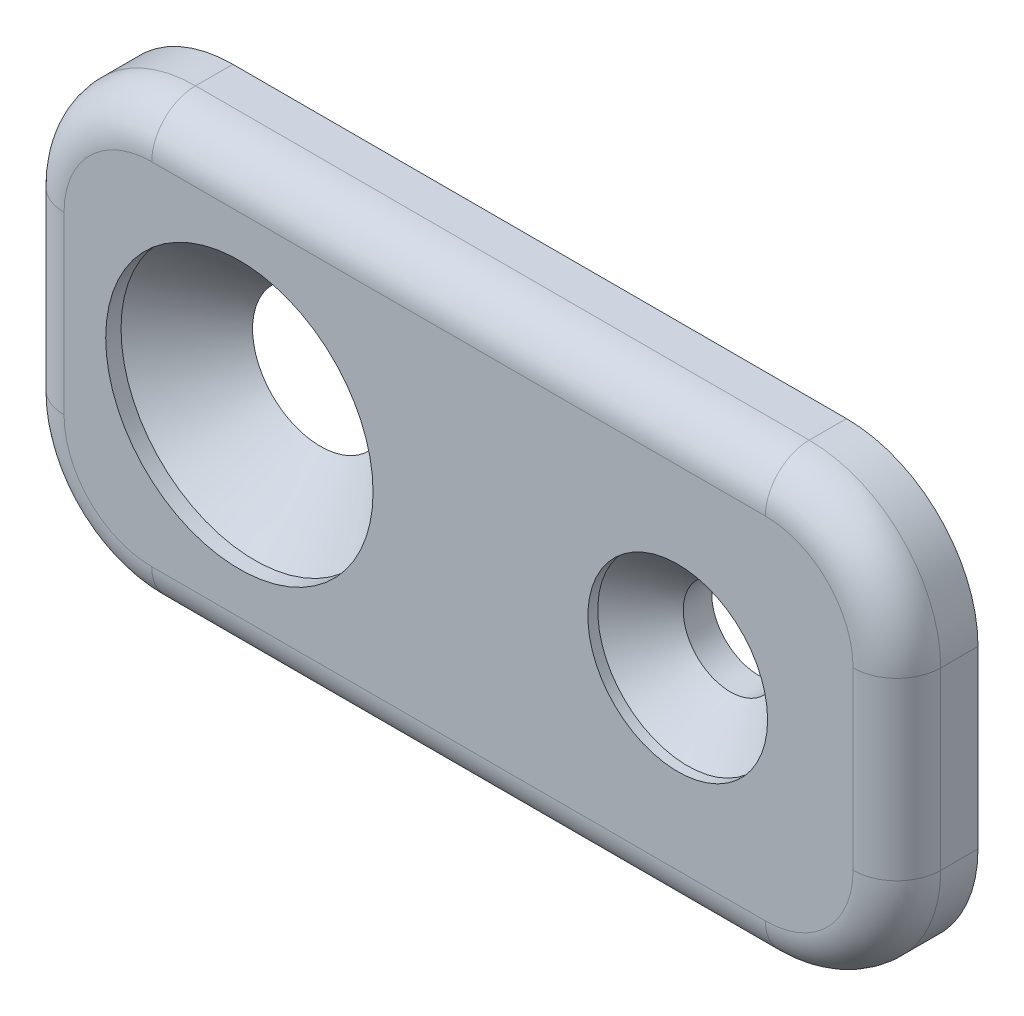
ISO-10303-21;
HEADER;
FILE_DESCRIPTION(('STEP AP214'),'2;1');
FILE_NAME('part.step','',(''),(''),'','','');
FILE_SCHEMA(('AUTOMOTIVE_DESIGN { 1 0 10303 214 1 1 1 1 }'));
ENDSEC;
DATA;
#1=APPLICATION_CONTEXT('core data for automotive mechanical design processes');
#2=APPLICATION_PROTOCOL_DEFINITION('international standard','automotive_design',2000,#1);
#3=PRODUCT_CONTEXT('',#1,'mechanical');
#4=PRODUCT('Part','Part','',(#3));
#5=PRODUCT_RELATED_PRODUCT_CATEGORY('part','',(#4));
#6=PRODUCT_DEFINITION_FORMATION('','',#4);
#7=PRODUCT_DEFINITION_CONTEXT('part definition',#1,'design');
#8=PRODUCT_DEFINITION('design','',#6,#7);
#9=PRODUCT_DEFINITION_SHAPE('','',#8);
#10=(LENGTH_UNIT() NAMED_UNIT(*) SI_UNIT(.MILLI.,.METRE.));
#11=(NAMED_UNIT(*) PLANE_ANGLE_UNIT() SI_UNIT($,.RADIAN.));
#12=(NAMED_UNIT(*) SI_UNIT($,.STERADIAN.) SOLID_ANGLE_UNIT());
#13=UNCERTAINTY_MEASURE_WITH_UNIT(LENGTH_MEASURE(1.E-05),#10,'distance_accuracy_value','');
#14=(GEOMETRIC_REPRESENTATION_CONTEXT(3) GLOBAL_UNCERTAINTY_ASSIGNED_CONTEXT((#13)) GLOBAL_UNIT_ASSIGNED_CONTEXT((#10,
#11,#12)) REPRESENTATION_CONTEXT('',''));
#15=CARTESIAN_POINT('',(0.,0.,0.));
#16=DIRECTION('',(0.,0.,1.));
#17=DIRECTION('',(1.,0.,0.));
#18=AXIS2_PLACEMENT_3D('',#15,#16,#17);
#19=CARTESIAN_POINT('',(20.,0.,3.7));
#20=DIRECTION('',(0.,0.,-1.));
#21=DIRECTION('',(-1.,0.,0.));
#22=AXIS2_PLACEMENT_3D('',#19,#20,#21);
#23=CYLINDRICAL_SURFACE('',#22,2.15);
#24=CARTESIAN_POINT('',(20.,0.,1.29999999999996));
#25=DIRECTION('',(0.,0.,1.));
#26=DIRECTION('',(1.,0.,0.));
#27=AXIS2_PLACEMENT_3D('',#24,#25,#26);
#28=CIRCLE('',#27,2.15);
#29=CARTESIAN_POINT('',(22.15,0.,1.29999999999996));
#30=VERTEX_POINT('',#29);
#31=EDGE_CURVE('E160',#30,#30,#28,.T.);
#32=ORIENTED_EDGE('',*,*,#31,.T.);
#33=EDGE_LOOP('',(#32));
#34=FACE_BOUND('',#33,.T.);
#35=CARTESIAN_POINT('',(20.,0.,0.));
#36=DIRECTION('',(0.,0.,1.));
#37=DIRECTION('',(1.,0.,0.));
#38=AXIS2_PLACEMENT_3D('',#35,#36,#37);
#39=CIRCLE('',#38,2.15);
#40=CARTESIAN_POINT('',(22.15,0.,0.));
#41=VERTEX_POINT('',#40);
#42=EDGE_CURVE('E253',#41,#41,#39,.T.);
#43=ORIENTED_EDGE('',*,*,#42,.F.);
#44=EDGE_LOOP('',(#43));
#45=FACE_BOUND('',#44,.T.);
#46=ADVANCED_FACE('F36',(#34,#45),#23,.F.);
#47=CARTESIAN_POINT('',(0.,0.,3.7));
#48=DIRECTION('',(0.,0.,-1.));
#49=DIRECTION('',(-1.,0.,0.));
#50=AXIS2_PLACEMENT_3D('',#47,#48,#49);
#51=PLANE('',#50);
#52=CARTESIAN_POINT('',(-4.,-4.00000000000001,3.7));
#53=DIRECTION('',(0.,0.,-1.));
#54=DIRECTION('',(-1.,0.,0.));
#55=AXIS2_PLACEMENT_3D('',#52,#53,#54);
#56=CIRCLE('',#55,4.);
#57=CARTESIAN_POINT('',(-8.,-4.00000000000001,3.7));
#58=VERTEX_POINT('',#57);
#59=CARTESIAN_POINT('',(-4.,-8.00000000000001,3.7));
#60=VERTEX_POINT('',#59);
#61=EDGE_CURVE('E186',#58,#60,#56,.F.);
#62=ORIENTED_EDGE('',*,*,#61,.T.);
#63=DIRECTION('',(1.,0.,0.));
#64=VECTOR('',#63,1.);
#65=CARTESIAN_POINT('',(0.,-8.00000000000001,3.7));
#66=LINE('',#65,#64);
#67=CARTESIAN_POINT('',(24.,-8.,3.7));
#68=VERTEX_POINT('',#67);
#69=EDGE_CURVE('E200',#60,#68,#66,.T.);
#70=ORIENTED_EDGE('',*,*,#69,.T.);
#71=CARTESIAN_POINT('',(24.,-4.,3.7));
#72=DIRECTION('',(0.,0.,-1.));
#73=DIRECTION('',(-1.,0.,0.));
#74=AXIS2_PLACEMENT_3D('',#71,#72,#73);
#75=CIRCLE('',#74,4.);
#76=CARTESIAN_POINT('',(28.,-4.,3.7));
#77=VERTEX_POINT('',#76);
#78=EDGE_CURVE('E198',#68,#77,#75,.F.);
#79=ORIENTED_EDGE('',*,*,#78,.T.);
#80=DIRECTION('',(0.,1.,0.));
#81=VECTOR('',#80,1.);
#82=CARTESIAN_POINT('',(28.,0.,3.7));
#83=LINE('',#82,#81);
#84=CARTESIAN_POINT('',(28.,4.,3.7));
#85=VERTEX_POINT('',#84);
#86=EDGE_CURVE('E196',#77,#85,#83,.T.);
#87=ORIENTED_EDGE('',*,*,#86,.T.);
#88=CARTESIAN_POINT('',(24.,4.,3.7));
#89=DIRECTION('',(0.,0.,-1.));
#90=DIRECTION('',(-1.,0.,0.));
#91=AXIS2_PLACEMENT_3D('',#88,#89,#90);
#92=CIRCLE('',#91,4.);
#93=CARTESIAN_POINT('',(24.,8.,3.7));
#94=VERTEX_POINT('',#93);
#95=EDGE_CURVE('E194',#85,#94,#92,.F.);
#96=ORIENTED_EDGE('',*,*,#95,.T.);
#97=DIRECTION('',(-1.,0.,0.));
#98=VECTOR('',#97,1.);
#99=CARTESIAN_POINT('',(0.,7.99999999999999,3.7));
#100=LINE('',#99,#98);
#101=CARTESIAN_POINT('',(-4.,7.99999999999999,3.7));
#102=VERTEX_POINT('',#101);
#103=EDGE_CURVE('E192',#94,#102,#100,.T.);
#104=ORIENTED_EDGE('',*,*,#103,.T.);
#105=CARTESIAN_POINT('',(-4.,3.99999999999999,3.7));
#106=DIRECTION('',(0.,0.,-1.));
#107=DIRECTION('',(-1.,0.,0.));
#108=AXIS2_PLACEMENT_3D('',#105,#106,#107);
#109=CIRCLE('',#108,4.);
#110=CARTESIAN_POINT('',(-8.,3.99999999999999,3.7));
#111=VERTEX_POINT('',#110);
#112=EDGE_CURVE('E190',#102,#111,#109,.F.);
#113=ORIENTED_EDGE('',*,*,#112,.T.);
#114=DIRECTION('',(0.,-1.,0.));
#115=VECTOR('',#114,1.);
#116=CARTESIAN_POINT('',(-8.,0.,3.7));
#117=LINE('',#116,#115);
#118=EDGE_CURVE('E188',#111,#58,#117,.T.);
#119=ORIENTED_EDGE('',*,*,#118,.T.);
#120=EDGE_LOOP('',(#62,#70,#79,#87,#96,#104,#113,#119));
#121=FACE_BOUND('',#120,.T.);
#122=CARTESIAN_POINT('',(20.,0.,3.7));
#123=DIRECTION('',(0.,0.,1.));
#124=DIRECTION('',(1.,0.,0.));
#125=AXIS2_PLACEMENT_3D('',#122,#123,#124);
#126=CIRCLE('',#125,4.1);
#127=CARTESIAN_POINT('',(24.1,0.,3.7));
#128=VERTEX_POINT('',#127);
#129=EDGE_CURVE('E238',#128,#128,#126,.T.);
#130=ORIENTED_EDGE('',*,*,#129,.F.);
#131=EDGE_LOOP('',(#130));
#132=FACE_BOUND('',#131,.T.);
#133=CARTESIAN_POINT('',(0.,0.,3.7));
#134=DIRECTION('',(0.,0.,1.));
#135=DIRECTION('',(1.,0.,0.));
#136=AXIS2_PLACEMENT_3D('',#133,#134,#135);
#137=CIRCLE('',#136,6.1);
#138=CARTESIAN_POINT('',(6.1,0.,3.7));
#139=VERTEX_POINT('',#138);
#140=EDGE_CURVE('E244',#139,#139,#137,.T.);
#141=ORIENTED_EDGE('',*,*,#140,.F.);
#142=EDGE_LOOP('',(#141));
#143=FACE_BOUND('',#142,.T.);
#144=ADVANCED_FACE('F279',(#121,#132,#143),#51,.F.);
#145=CARTESIAN_POINT('',(0.,0.,0.));
#146=DIRECTION('',(0.,0.,-1.));
#147=DIRECTION('',(-1.,0.,0.));
#148=AXIS2_PLACEMENT_3D('',#145,#146,#147);
#149=PLANE('',#148);
#150=CARTESIAN_POINT('',(0.,0.,0.));
#151=DIRECTION('',(0.,0.,1.));
#152=DIRECTION('',(1.,0.,0.));
#153=AXIS2_PLACEMENT_3D('',#150,#151,#152);
#154=CIRCLE('',#153,3.1);
#155=CARTESIAN_POINT('',(3.1,0.,0.));
#156=VERTEX_POINT('',#155);
#157=EDGE_CURVE('E257',#156,#156,#154,.T.);
#158=ORIENTED_EDGE('',*,*,#157,.T.);
#159=EDGE_LOOP('',(#158));
#160=FACE_BOUND('',#159,.T.);
#161=DIRECTION('',(0.,1.,0.));
#162=VECTOR('',#161,1.);
#163=CARTESIAN_POINT('',(30.,10.,0.));
#164=LINE('',#163,#162);
#165=CARTESIAN_POINT('',(30.,-4.,0.));
#166=VERTEX_POINT('',#165);
#167=CARTESIAN_POINT('',(30.,4.,0.));
#168=VERTEX_POINT('',#167);
#169=EDGE_CURVE('E131',#166,#168,#164,.T.);
#170=ORIENTED_EDGE('',*,*,#169,.F.);
#171=CARTESIAN_POINT('',(24.,-4.,0.));
#172=DIRECTION('',(0.,0.,-1.));
#173=DIRECTION('',(-1.,0.,0.));
#174=AXIS2_PLACEMENT_3D('',#171,#172,#173);
#175=CIRCLE('',#174,6.);
#176=CARTESIAN_POINT('',(24.,-10.,0.));
#177=VERTEX_POINT('',#176);
#178=EDGE_CURVE('E141',#166,#177,#175,.T.);
#179=ORIENTED_EDGE('',*,*,#178,.T.);
#180=DIRECTION('',(1.,0.,0.));
#181=VECTOR('',#180,1.);
#182=CARTESIAN_POINT('',(30.,-10.,0.));
#183=LINE('',#182,#181);
#184=CARTESIAN_POINT('',(-4.,-10.,0.));
#185=VERTEX_POINT('',#184);
#186=EDGE_CURVE('E157',#185,#177,#183,.T.);
#187=ORIENTED_EDGE('',*,*,#186,.F.);
#188=CARTESIAN_POINT('',(-4.,-4.00000000000001,0.));
#189=DIRECTION('',(0.,0.,-1.));
#190=DIRECTION('',(-1.,0.,0.));
#191=AXIS2_PLACEMENT_3D('',#188,#189,#190);
#192=CIRCLE('',#191,6.);
#193=CARTESIAN_POINT('',(-10.,-4.00000000000001,0.));
#194=VERTEX_POINT('',#193);
#195=EDGE_CURVE('E149',#185,#194,#192,.T.);
#196=ORIENTED_EDGE('',*,*,#195,.T.);
#197=DIRECTION('',(0.,-1.,0.));
#198=VECTOR('',#197,1.);
#199=CARTESIAN_POINT('',(-10.,9.99999999999999,0.));
#200=LINE('',#199,#198);
#201=CARTESIAN_POINT('',(-10.,3.99999999999999,0.));
#202=VERTEX_POINT('',#201);
#203=EDGE_CURVE('E162',#202,#194,#200,.T.);
#204=ORIENTED_EDGE('',*,*,#203,.F.);
#205=CARTESIAN_POINT('',(-4.,3.99999999999999,0.));
#206=DIRECTION('',(0.,0.,-1.));
#207=DIRECTION('',(-1.,0.,0.));
#208=AXIS2_PLACEMENT_3D('',#205,#206,#207);
#209=CIRCLE('',#208,6.);
#210=CARTESIAN_POINT('',(-4.,9.99999999999999,0.));
#211=VERTEX_POINT('',#210);
#212=EDGE_CURVE('E137',#202,#211,#209,.T.);
#213=ORIENTED_EDGE('',*,*,#212,.T.);
#214=DIRECTION('',(-1.,0.,0.));
#215=VECTOR('',#214,1.);
#216=CARTESIAN_POINT('',(30.,10.,0.));
#217=LINE('',#216,#215);
#218=CARTESIAN_POINT('',(24.,10.,0.));
#219=VERTEX_POINT('',#218);
#220=EDGE_CURVE('E156',#219,#211,#217,.T.);
#221=ORIENTED_EDGE('',*,*,#220,.F.);
#222=CARTESIAN_POINT('',(24.,4.,0.));
#223=DIRECTION('',(0.,0.,-1.));
#224=DIRECTION('',(-1.,0.,0.));
#225=AXIS2_PLACEMENT_3D('',#222,#223,#224);
#226=CIRCLE('',#225,6.);
#227=EDGE_CURVE('E155',#219,#168,#226,.T.);
#228=ORIENTED_EDGE('',*,*,#227,.T.);
#229=EDGE_LOOP('',(#170,#179,#187,#196,#204,#213,#221,#228));
#230=FACE_BOUND('',#229,.T.);
#231=ORIENTED_EDGE('',*,*,#42,.T.);
#232=EDGE_LOOP('',(#231));
#233=FACE_BOUND('',#232,.T.);
#234=ADVANCED_FACE('F151',(#160,#230,#233),#149,.T.);
#235=CARTESIAN_POINT('',(-10.,9.99999999999999,3.7));
#236=DIRECTION('',(1.,0.,0.));
#237=DIRECTION('',(0.,1.,0.));
#238=AXIS2_PLACEMENT_3D('',#235,#236,#237);
#239=PLANE('',#238);
#240=DIRECTION('',(0.,0.,-1.));
#241=VECTOR('',#240,1.);
#242=CARTESIAN_POINT('',(-10.,-4.00000000000001,3.7));
#243=LINE('',#242,#241);
#244=CARTESIAN_POINT('',(-10.,-4.00000000000001,1.7));
#245=VERTEX_POINT('',#244);
#246=EDGE_CURVE('E179',#194,#245,#243,.F.);
#247=ORIENTED_EDGE('',*,*,#246,.T.);
#248=DIRECTION('',(0.,-1.,0.));
#249=VECTOR('',#248,1.);
#250=CARTESIAN_POINT('',(-10.,9.99999999999999,1.7));
#251=LINE('',#250,#249);
#252=CARTESIAN_POINT('',(-10.,3.99999999999999,1.7));
#253=VERTEX_POINT('',#252);
#254=EDGE_CURVE('E45',#245,#253,#251,.F.);
#255=ORIENTED_EDGE('',*,*,#254,.T.);
#256=DIRECTION('',(0.,0.,-1.));
#257=VECTOR('',#256,1.);
#258=CARTESIAN_POINT('',(-10.,3.99999999999999,3.7));
#259=LINE('',#258,#257);
#260=EDGE_CURVE('E177',#253,#202,#259,.T.);
#261=ORIENTED_EDGE('',*,*,#260,.T.);
#262=ORIENTED_EDGE('',*,*,#203,.T.);
#263=EDGE_LOOP('',(#247,#255,#261,#262));
#264=FACE_BOUND('',#263,.T.);
#265=ADVANCED_FACE('F261',(#264),#239,.F.);
#266=CARTESIAN_POINT('',(30.,-10.,3.7));
#267=DIRECTION('',(0.,1.,0.));
#268=DIRECTION('',(-1.,0.,0.));
#269=AXIS2_PLACEMENT_3D('',#266,#267,#268);
#270=PLANE('',#269);
#271=DIRECTION('',(0.,0.,-1.));
#272=VECTOR('',#271,1.);
#273=CARTESIAN_POINT('',(24.,-10.,3.7));
#274=LINE('',#273,#272);
#275=CARTESIAN_POINT('',(24.,-10.,1.7));
#276=VERTEX_POINT('',#275);
#277=EDGE_CURVE('E144',#177,#276,#274,.F.);
#278=ORIENTED_EDGE('',*,*,#277,.T.);
#279=DIRECTION('',(1.,0.,0.));
#280=VECTOR('',#279,1.);
#281=CARTESIAN_POINT('',(30.,-10.,1.7));
#282=LINE('',#281,#280);
#283=CARTESIAN_POINT('',(-4.,-10.,1.7));
#284=VERTEX_POINT('',#283);
#285=EDGE_CURVE('E203',#276,#284,#282,.F.);
#286=ORIENTED_EDGE('',*,*,#285,.T.);
#287=DIRECTION('',(0.,0.,-1.));
#288=VECTOR('',#287,1.);
#289=CARTESIAN_POINT('',(-4.,-10.,3.7));
#290=LINE('',#289,#288);
#291=EDGE_CURVE('E148',#284,#185,#290,.T.);
#292=ORIENTED_EDGE('',*,*,#291,.T.);
#293=ORIENTED_EDGE('',*,*,#186,.T.);
#294=EDGE_LOOP('',(#278,#286,#292,#293));
#295=FACE_BOUND('',#294,.T.);
#296=ADVANCED_FACE('F266',(#295),#270,.F.);
#297=CARTESIAN_POINT('',(30.,10.,3.7));
#298=DIRECTION('',(-1.,0.,0.));
#299=DIRECTION('',(0.,0.,1.));
#300=AXIS2_PLACEMENT_3D('',#297,#298,#299);
#301=PLANE('',#300);
#302=DIRECTION('',(0.,0.,-1.));
#303=VECTOR('',#302,1.);
#304=CARTESIAN_POINT('',(30.,4.,3.7));
#305=LINE('',#304,#303);
#306=CARTESIAN_POINT('',(30.,4.,1.7));
#307=VERTEX_POINT('',#306);
#308=EDGE_CURVE('E138',#168,#307,#305,.F.);
#309=ORIENTED_EDGE('',*,*,#308,.T.);
#310=DIRECTION('',(0.,1.,0.));
#311=VECTOR('',#310,1.);
#312=CARTESIAN_POINT('',(30.,10.,1.7));
#313=LINE('',#312,#311);
#314=CARTESIAN_POINT('',(30.,-4.,1.7));
#315=VERTEX_POINT('',#314);
#316=EDGE_CURVE('E134',#307,#315,#313,.F.);
#317=ORIENTED_EDGE('',*,*,#316,.T.);
#318=DIRECTION('',(0.,0.,-1.));
#319=VECTOR('',#318,1.);
#320=CARTESIAN_POINT('',(30.,-4.,3.7));
#321=LINE('',#320,#319);
#322=EDGE_CURVE('E126',#315,#166,#321,.T.);
#323=ORIENTED_EDGE('',*,*,#322,.T.);
#324=ORIENTED_EDGE('',*,*,#169,.T.);
#325=EDGE_LOOP('',(#309,#317,#323,#324));
#326=FACE_BOUND('',#325,.T.);
#327=ADVANCED_FACE('F129',(#326),#301,.F.);
#328=CARTESIAN_POINT('',(30.,10.,3.7));
#329=DIRECTION('',(0.,-1.,0.));
#330=DIRECTION('',(1.,0.,0.));
#331=AXIS2_PLACEMENT_3D('',#328,#329,#330);
#332=PLANE('',#331);
#333=DIRECTION('',(0.,0.,-1.));
#334=VECTOR('',#333,1.);
#335=CARTESIAN_POINT('',(-4.,9.99999999999999,3.7));
#336=LINE('',#335,#334);
#337=CARTESIAN_POINT('',(-4.,9.99999999999999,1.7));
#338=VERTEX_POINT('',#337);
#339=EDGE_CURVE('E181',#211,#338,#336,.F.);
#340=ORIENTED_EDGE('',*,*,#339,.T.);
#341=DIRECTION('',(-1.,0.,0.));
#342=VECTOR('',#341,1.);
#343=CARTESIAN_POINT('',(30.,10.,1.7));
#344=LINE('',#343,#342);
#345=CARTESIAN_POINT('',(24.,10.,1.7));
#346=VERTEX_POINT('',#345);
#347=EDGE_CURVE('E211',#338,#346,#344,.F.);
#348=ORIENTED_EDGE('',*,*,#347,.T.);
#349=DIRECTION('',(0.,0.,-1.));
#350=VECTOR('',#349,1.);
#351=CARTESIAN_POINT('',(24.,10.,3.7));
#352=LINE('',#351,#350);
#353=EDGE_CURVE('E184',#346,#219,#352,.T.);
#354=ORIENTED_EDGE('',*,*,#353,.T.);
#355=ORIENTED_EDGE('',*,*,#220,.T.);
#356=EDGE_LOOP('',(#340,#348,#354,#355));
#357=FACE_BOUND('',#356,.T.);
#358=ADVANCED_FACE('F295',(#357),#332,.F.);
#359=CARTESIAN_POINT('',(0.,0.,3.));
#360=DIRECTION('',(0.,0.,1.));
#361=DIRECTION('',(1.,0.,0.));
#362=AXIS2_PLACEMENT_3D('',#359,#360,#361);
#363=CYLINDRICAL_SURFACE('',#362,6.1);
#364=CARTESIAN_POINT('',(0.,0.,3.));
#365=DIRECTION('',(0.,0.,1.));
#366=DIRECTION('',(1.,0.,0.));
#367=AXIS2_PLACEMENT_3D('',#364,#365,#366);
#368=CIRCLE('',#367,6.1);
#369=CARTESIAN_POINT('',(6.1,0.,3.));
#370=VERTEX_POINT('',#369);
#371=EDGE_CURVE('E249',#370,#370,#368,.T.);
#372=ORIENTED_EDGE('',*,*,#371,.F.);
#373=EDGE_LOOP('',(#372));
#374=FACE_BOUND('',#373,.T.);
#375=ORIENTED_EDGE('',*,*,#140,.T.);
#376=EDGE_LOOP('',(#375));
#377=FACE_BOUND('',#376,.T.);
#378=ADVANCED_FACE('F320',(#374,#377),#363,.F.);
#379=CARTESIAN_POINT('',(0.,0.,0.));
#380=DIRECTION('',(0.,0.,1.));
#381=DIRECTION('',(1.,0.,0.));
#382=AXIS2_PLACEMENT_3D('',#379,#380,#381);
#383=CONICAL_SURFACE('',#382,3.1,0.78539816339745);
#384=ORIENTED_EDGE('',*,*,#371,.T.);
#385=EDGE_LOOP('',(#384));
#386=FACE_BOUND('',#385,.T.);
#387=ORIENTED_EDGE('',*,*,#157,.F.);
#388=EDGE_LOOP('',(#387));
#389=FACE_BOUND('',#388,.T.);
#390=ADVANCED_FACE('F334',(#386,#389),#383,.F.);
#391=CARTESIAN_POINT('',(20.,0.,3.3));
#392=DIRECTION('',(0.,0.,1.));
#393=DIRECTION('',(1.,0.,0.));
#394=AXIS2_PLACEMENT_3D('',#391,#392,#393);
#395=CYLINDRICAL_SURFACE('',#394,4.1);
#396=CARTESIAN_POINT('',(20.,0.,3.24999999999999));
#397=DIRECTION('',(0.,0.,1.));
#398=DIRECTION('',(1.,0.,0.));
#399=AXIS2_PLACEMENT_3D('',#396,#397,#398);
#400=CIRCLE('',#399,4.1);
#401=CARTESIAN_POINT('',(24.1,0.,3.24999999999999));
#402=VERTEX_POINT('',#401);
#403=EDGE_CURVE('E168',#402,#402,#400,.F.);
#404=ORIENTED_EDGE('',*,*,#403,.T.);
#405=EDGE_LOOP('',(#404));
#406=FACE_BOUND('',#405,.T.);
#407=ORIENTED_EDGE('',*,*,#129,.T.);
#408=EDGE_LOOP('',(#407));
#409=FACE_BOUND('',#408,.T.);
#410=ADVANCED_FACE('F337',(#406,#409),#395,.F.);
#411=CARTESIAN_POINT('',(20.,0.,1.29999999999996));
#412=DIRECTION('',(0.,0.,1.));
#413=DIRECTION('',(1.,0.,0.));
#414=AXIS2_PLACEMENT_3D('',#411,#412,#413);
#415=CONICAL_SURFACE('',#414,2.15,0.785398163397443);
#416=ORIENTED_EDGE('',*,*,#403,.F.);
#417=EDGE_LOOP('',(#416));
#418=FACE_BOUND('',#417,.T.);
#419=ORIENTED_EDGE('',*,*,#31,.F.);
#420=EDGE_LOOP('',(#419));
#421=FACE_BOUND('',#420,.T.);
#422=ADVANCED_FACE('F339',(#418,#421),#415,.F.);
#423=CARTESIAN_POINT('',(24.,-4.,3.7));
#424=DIRECTION('',(0.,0.,-1.));
#425=DIRECTION('',(-1.,0.,0.));
#426=AXIS2_PLACEMENT_3D('',#423,#424,#425);
#427=CYLINDRICAL_SURFACE('',#426,6.);
#428=ORIENTED_EDGE('',*,*,#322,.F.);
#429=CARTESIAN_POINT('',(24.,-4.,1.7));
#430=DIRECTION('',(0.,0.,-1.));
#431=DIRECTION('',(-1.,0.,0.));
#432=AXIS2_PLACEMENT_3D('',#429,#430,#431);
#433=CIRCLE('',#432,6.);
#434=EDGE_CURVE('E206',#315,#276,#433,.T.);
#435=ORIENTED_EDGE('',*,*,#434,.T.);
#436=ORIENTED_EDGE('',*,*,#277,.F.);
#437=ORIENTED_EDGE('',*,*,#178,.F.);
#438=EDGE_LOOP('',(#428,#435,#436,#437));
#439=FACE_BOUND('',#438,.T.);
#440=ADVANCED_FACE('F142',(#439),#427,.T.);
#441=CARTESIAN_POINT('',(-4.,-4.00000000000001,3.7));
#442=DIRECTION('',(0.,0.,-1.));
#443=DIRECTION('',(-1.,0.,0.));
#444=AXIS2_PLACEMENT_3D('',#441,#442,#443);
#445=CYLINDRICAL_SURFACE('',#444,6.);
#446=ORIENTED_EDGE('',*,*,#291,.F.);
#447=CARTESIAN_POINT('',(-4.,-4.00000000000001,1.7));
#448=DIRECTION('',(0.,0.,-1.));
#449=DIRECTION('',(-1.,0.,0.));
#450=AXIS2_PLACEMENT_3D('',#447,#448,#449);
#451=CIRCLE('',#450,6.);
#452=EDGE_CURVE('E11',#284,#245,#451,.T.);
#453=ORIENTED_EDGE('',*,*,#452,.T.);
#454=ORIENTED_EDGE('',*,*,#246,.F.);
#455=ORIENTED_EDGE('',*,*,#195,.F.);
#456=EDGE_LOOP('',(#446,#453,#454,#455));
#457=FACE_BOUND('',#456,.T.);
#458=ADVANCED_FACE('F264',(#457),#445,.T.);
#459=CARTESIAN_POINT('',(24.,4.,3.7));
#460=DIRECTION('',(0.,0.,-1.));
#461=DIRECTION('',(-1.,0.,0.));
#462=AXIS2_PLACEMENT_3D('',#459,#460,#461);
#463=CYLINDRICAL_SURFACE('',#462,6.);
#464=ORIENTED_EDGE('',*,*,#353,.F.);
#465=CARTESIAN_POINT('',(24.,4.,1.7));
#466=DIRECTION('',(0.,0.,-1.));
#467=DIRECTION('',(-1.,0.,0.));
#468=AXIS2_PLACEMENT_3D('',#465,#466,#467);
#469=CIRCLE('',#468,6.);
#470=EDGE_CURVE('E209',#346,#307,#469,.T.);
#471=ORIENTED_EDGE('',*,*,#470,.T.);
#472=ORIENTED_EDGE('',*,*,#308,.F.);
#473=ORIENTED_EDGE('',*,*,#227,.F.);
#474=EDGE_LOOP('',(#464,#471,#472,#473));
#475=FACE_BOUND('',#474,.T.);
#476=ADVANCED_FACE('F302',(#475),#463,.T.);
#477=CARTESIAN_POINT('',(-4.,3.99999999999999,3.7));
#478=DIRECTION('',(0.,0.,-1.));
#479=DIRECTION('',(-1.,0.,0.));
#480=AXIS2_PLACEMENT_3D('',#477,#478,#479);
#481=CYLINDRICAL_SURFACE('',#480,6.);
#482=ORIENTED_EDGE('',*,*,#260,.F.);
#483=CARTESIAN_POINT('',(-4.,3.99999999999999,1.7));
#484=DIRECTION('',(0.,0.,-1.));
#485=DIRECTION('',(-1.,0.,0.));
#486=AXIS2_PLACEMENT_3D('',#483,#484,#485);
#487=CIRCLE('',#486,6.);
#488=EDGE_CURVE('E213',#253,#338,#487,.T.);
#489=ORIENTED_EDGE('',*,*,#488,.T.);
#490=ORIENTED_EDGE('',*,*,#339,.F.);
#491=ORIENTED_EDGE('',*,*,#212,.F.);
#492=EDGE_LOOP('',(#482,#489,#490,#491));
#493=FACE_BOUND('',#492,.T.);
#494=ADVANCED_FACE('F292',(#493),#481,.T.);
#495=CARTESIAN_POINT('',(0.,7.99999999999999,1.7));
#496=DIRECTION('',(-1.,0.,0.));
#497=DIRECTION('',(0.,-1.,0.));
#498=AXIS2_PLACEMENT_3D('',#495,#496,#497);
#499=CYLINDRICAL_SURFACE('',#498,2.);
#500=CARTESIAN_POINT('',(24.,8.,1.7));
#501=DIRECTION('',(1.,0.,0.));
#502=DIRECTION('',(0.,0.,-1.));
#503=AXIS2_PLACEMENT_3D('',#500,#501,#502);
#504=CIRCLE('',#503,2.);
#505=EDGE_CURVE('E231',#346,#94,#504,.T.);
#506=ORIENTED_EDGE('',*,*,#505,.F.);
#507=ORIENTED_EDGE('',*,*,#347,.F.);
#508=CARTESIAN_POINT('',(-4.,7.99999999999999,1.7));
#509=DIRECTION('',(-1.,0.,0.));
#510=DIRECTION('',(0.,0.,1.));
#511=AXIS2_PLACEMENT_3D('',#508,#509,#510);
#512=CIRCLE('',#511,2.);
#513=EDGE_CURVE('E40',#102,#338,#512,.T.);
#514=ORIENTED_EDGE('',*,*,#513,.F.);
#515=ORIENTED_EDGE('',*,*,#103,.F.);
#516=EDGE_LOOP('',(#506,#507,#514,#515));
#517=FACE_BOUND('',#516,.T.);
#518=ADVANCED_FACE('F38',(#517),#499,.T.);
#519=CARTESIAN_POINT('',(-4.,3.99999999999999,1.7));
#520=DIRECTION('',(0.,0.,-1.));
#521=DIRECTION('',(-1.,0.,0.));
#522=AXIS2_PLACEMENT_3D('',#519,#520,#521);
#523=TOROIDAL_SURFACE('',#522,4.,2.);
#524=ORIENTED_EDGE('',*,*,#513,.T.);
#525=ORIENTED_EDGE('',*,*,#488,.F.);
#526=CARTESIAN_POINT('',(-8.,3.99999999999999,1.7));
#527=DIRECTION('',(0.,-1.,0.));
#528=DIRECTION('',(0.,0.,-1.));
#529=AXIS2_PLACEMENT_3D('',#526,#527,#528);
#530=CIRCLE('',#529,2.);
#531=EDGE_CURVE('E229',#111,#253,#530,.T.);
#532=ORIENTED_EDGE('',*,*,#531,.F.);
#533=ORIENTED_EDGE('',*,*,#112,.F.);
#534=EDGE_LOOP('',(#524,#525,#532,#533));
#535=FACE_BOUND('',#534,.T.);
#536=ADVANCED_FACE('F289',(#535),#523,.T.);
#537=CARTESIAN_POINT('',(24.,4.,1.7));
#538=DIRECTION('',(0.,0.,-1.));
#539=DIRECTION('',(-1.,0.,0.));
#540=AXIS2_PLACEMENT_3D('',#537,#538,#539);
#541=TOROIDAL_SURFACE('',#540,4.,2.);
#542=ORIENTED_EDGE('',*,*,#505,.T.);
#543=ORIENTED_EDGE('',*,*,#95,.F.);
#544=CARTESIAN_POINT('',(28.,4.,1.7));
#545=DIRECTION('',(0.,-1.,0.));
#546=DIRECTION('',(0.,0.,-1.));
#547=AXIS2_PLACEMENT_3D('',#544,#545,#546);
#548=CIRCLE('',#547,2.);
#549=EDGE_CURVE('E226',#307,#85,#548,.T.);
#550=ORIENTED_EDGE('',*,*,#549,.F.);
#551=ORIENTED_EDGE('',*,*,#470,.F.);
#552=EDGE_LOOP('',(#542,#543,#550,#551));
#553=FACE_BOUND('',#552,.T.);
#554=ADVANCED_FACE('F300',(#553),#541,.T.);
#555=CARTESIAN_POINT('',(-8.,0.,1.7));
#556=DIRECTION('',(0.,-1.,0.));
#557=DIRECTION('',(1.,0.,0.));
#558=AXIS2_PLACEMENT_3D('',#555,#556,#557);
#559=CYLINDRICAL_SURFACE('',#558,2.);
#560=ORIENTED_EDGE('',*,*,#531,.T.);
#561=ORIENTED_EDGE('',*,*,#254,.F.);
#562=CARTESIAN_POINT('',(-8.,-4.00000000000001,1.7));
#563=DIRECTION('',(0.,-1.,0.));
#564=DIRECTION('',(0.,0.,-1.));
#565=AXIS2_PLACEMENT_3D('',#562,#563,#564);
#566=CIRCLE('',#565,2.);
#567=EDGE_CURVE('E223',#58,#245,#566,.T.);
#568=ORIENTED_EDGE('',*,*,#567,.F.);
#569=ORIENTED_EDGE('',*,*,#118,.F.);
#570=EDGE_LOOP('',(#560,#561,#568,#569));
#571=FACE_BOUND('',#570,.T.);
#572=ADVANCED_FACE('F287',(#571),#559,.T.);
#573=CARTESIAN_POINT('',(28.,0.,1.7));
#574=DIRECTION('',(0.,1.,0.));
#575=DIRECTION('',(0.,0.,1.));
#576=AXIS2_PLACEMENT_3D('',#573,#574,#575);
#577=CYLINDRICAL_SURFACE('',#576,2.);
#578=ORIENTED_EDGE('',*,*,#549,.T.);
#579=ORIENTED_EDGE('',*,*,#86,.F.);
#580=CARTESIAN_POINT('',(28.,-4.,1.7));
#581=DIRECTION('',(0.,-1.,0.));
#582=DIRECTION('',(0.,0.,-1.));
#583=AXIS2_PLACEMENT_3D('',#580,#581,#582);
#584=CIRCLE('',#583,2.);
#585=EDGE_CURVE('E220',#315,#77,#584,.T.);
#586=ORIENTED_EDGE('',*,*,#585,.F.);
#587=ORIENTED_EDGE('',*,*,#316,.F.);
#588=EDGE_LOOP('',(#578,#579,#586,#587));
#589=FACE_BOUND('',#588,.T.);
#590=ADVANCED_FACE('F397',(#589),#577,.T.);
#591=CARTESIAN_POINT('',(-4.,-4.00000000000001,1.7));
#592=DIRECTION('',(0.,0.,-1.));
#593=DIRECTION('',(-1.,0.,0.));
#594=AXIS2_PLACEMENT_3D('',#591,#592,#593);
#595=TOROIDAL_SURFACE('',#594,4.,2.);
#596=ORIENTED_EDGE('',*,*,#567,.T.);
#597=ORIENTED_EDGE('',*,*,#452,.F.);
#598=CARTESIAN_POINT('',(-4.,-8.00000000000001,1.7));
#599=DIRECTION('',(1.,0.,0.));
#600=DIRECTION('',(0.,0.,-1.));
#601=AXIS2_PLACEMENT_3D('',#598,#599,#600);
#602=CIRCLE('',#601,2.);
#603=EDGE_CURVE('E218',#60,#284,#602,.T.);
#604=ORIENTED_EDGE('',*,*,#603,.F.);
#605=ORIENTED_EDGE('',*,*,#61,.F.);
#606=EDGE_LOOP('',(#596,#597,#604,#605));
#607=FACE_BOUND('',#606,.T.);
#608=ADVANCED_FACE('F285',(#607),#595,.T.);
#609=CARTESIAN_POINT('',(24.,-4.,1.7));
#610=DIRECTION('',(0.,0.,-1.));
#611=DIRECTION('',(-1.,0.,0.));
#612=AXIS2_PLACEMENT_3D('',#609,#610,#611);
#613=TOROIDAL_SURFACE('',#612,4.,2.);
#614=ORIENTED_EDGE('',*,*,#585,.T.);
#615=ORIENTED_EDGE('',*,*,#78,.F.);
#616=CARTESIAN_POINT('',(24.,-8.,1.7));
#617=DIRECTION('',(-1.,0.,0.));
#618=DIRECTION('',(0.,0.,1.));
#619=AXIS2_PLACEMENT_3D('',#616,#617,#618);
#620=CIRCLE('',#619,2.);
#621=EDGE_CURVE('E216',#276,#68,#620,.T.);
#622=ORIENTED_EDGE('',*,*,#621,.F.);
#623=ORIENTED_EDGE('',*,*,#434,.F.);
#624=EDGE_LOOP('',(#614,#615,#622,#623));
#625=FACE_BOUND('',#624,.T.);
#626=ADVANCED_FACE('F276',(#625),#613,.T.);
#627=CARTESIAN_POINT('',(0.,-8.00000000000001,1.7));
#628=DIRECTION('',(1.,0.,0.));
#629=DIRECTION('',(0.,1.,0.));
#630=AXIS2_PLACEMENT_3D('',#627,#628,#629);
#631=CYLINDRICAL_SURFACE('',#630,2.);
#632=ORIENTED_EDGE('',*,*,#603,.T.);
#633=ORIENTED_EDGE('',*,*,#285,.F.);
#634=ORIENTED_EDGE('',*,*,#621,.T.);
#635=ORIENTED_EDGE('',*,*,#69,.F.);
#636=EDGE_LOOP('',(#632,#633,#634,#635));
#637=FACE_BOUND('',#636,.T.);
#638=ADVANCED_FACE('F270',(#637),#631,.T.);
#639=CLOSED_SHELL('',(#46,#144,#234,#265,#296,#327,#358,#378,#390,#410,#422,#440,#458,#476,#494,
#518,#536,#554,#572,#590,#608,#626,#638));
#640=MANIFOLD_SOLID_BREP('B2',#639);
#641=ADVANCED_BREP_SHAPE_REPRESENTATION('',(#18,#640),#14);
#642=SHAPE_DEFINITION_REPRESENTATION(#9,#641);
ENDSEC;
END-ISO-10303-21;
